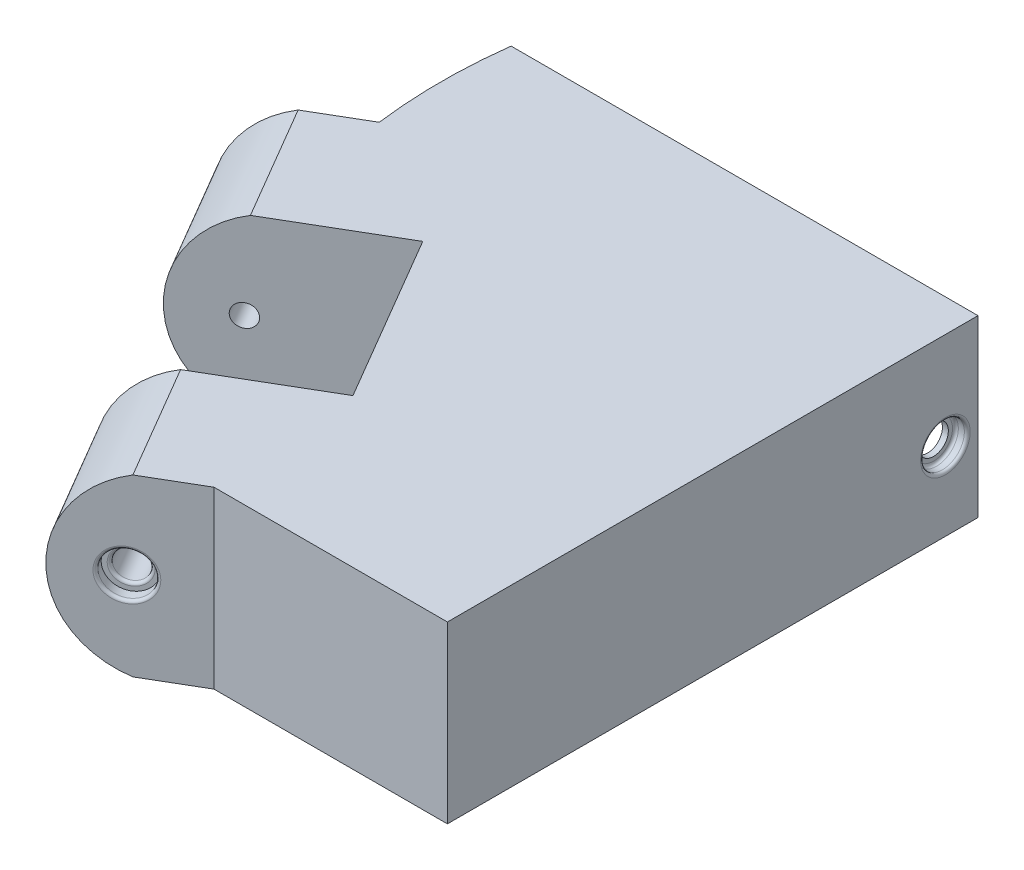
ISO-10303-21;
HEADER;
FILE_DESCRIPTION(('STEP AP214'),'2;1');
FILE_NAME('part.step','',(''),(''),'','','');
FILE_SCHEMA(('AUTOMOTIVE_DESIGN { 1 0 10303 214 1 1 1 1 }'));
ENDSEC;
DATA;
#1=APPLICATION_CONTEXT('core data for automotive mechanical design processes');
#2=APPLICATION_PROTOCOL_DEFINITION('international standard','automotive_design',2000,#1);
#3=PRODUCT_CONTEXT('',#1,'mechanical');
#4=PRODUCT('Part','Part','',(#3));
#5=PRODUCT_RELATED_PRODUCT_CATEGORY('part','',(#4));
#6=PRODUCT_DEFINITION_FORMATION('','',#4);
#7=PRODUCT_DEFINITION_CONTEXT('part definition',#1,'design');
#8=PRODUCT_DEFINITION('design','',#6,#7);
#9=PRODUCT_DEFINITION_SHAPE('','',#8);
#10=(LENGTH_UNIT() NAMED_UNIT(*) SI_UNIT(.MILLI.,.METRE.));
#11=(NAMED_UNIT(*) PLANE_ANGLE_UNIT() SI_UNIT($,.RADIAN.));
#12=(NAMED_UNIT(*) SI_UNIT($,.STERADIAN.) SOLID_ANGLE_UNIT());
#13=UNCERTAINTY_MEASURE_WITH_UNIT(LENGTH_MEASURE(1.E-05),#10,'distance_accuracy_value','');
#14=(GEOMETRIC_REPRESENTATION_CONTEXT(3) GLOBAL_UNCERTAINTY_ASSIGNED_CONTEXT((#13)) GLOBAL_UNIT_ASSIGNED_CONTEXT((#10,
#11,#12)) REPRESENTATION_CONTEXT('',''));
#15=CARTESIAN_POINT('',(0.,0.,0.));
#16=DIRECTION('',(0.,0.,1.));
#17=DIRECTION('',(1.,0.,0.));
#18=AXIS2_PLACEMENT_3D('',#15,#16,#17);
#19=CARTESIAN_POINT('',(0.,29.972,-45.466));
#20=DIRECTION('',(0.,0.,-1.));
#21=DIRECTION('',(-1.,0.,0.));
#22=AXIS2_PLACEMENT_3D('',#19,#20,#21);
#23=PLANE('',#22);
#24=DIRECTION('',(1.,0.,0.));
#25=VECTOR('',#24,1.);
#26=CARTESIAN_POINT('',(0.,0.,-45.466));
#27=LINE('',#26,#25);
#28=CARTESIAN_POINT('',(36.957,0.,-45.466));
#29=VERTEX_POINT('',#28);
#30=CARTESIAN_POINT('',(40.005,0.,-45.466));
#31=VERTEX_POINT('',#30);
#32=EDGE_CURVE('E80',#29,#31,#27,.T.);
#33=ORIENTED_EDGE('',*,*,#32,.F.);
#34=DIRECTION('',(0.,1.,0.));
#35=VECTOR('',#34,1.);
#36=CARTESIAN_POINT('',(36.957,0.,-45.466));
#37=LINE('',#36,#35);
#38=CARTESIAN_POINT('',(36.957,25.4,-45.466));
#39=VERTEX_POINT('',#38);
#40=EDGE_CURVE('E317',#29,#39,#37,.T.);
#41=ORIENTED_EDGE('',*,*,#40,.T.);
#42=DIRECTION('',(-1.,0.,0.));
#43=VECTOR('',#42,1.);
#44=CARTESIAN_POINT('',(36.957,25.4,-45.466));
#45=LINE('',#44,#43);
#46=CARTESIAN_POINT('',(-37.0121268521548,25.4,-45.466));
#47=VERTEX_POINT('',#46);
#48=EDGE_CURVE('E422',#39,#47,#45,.T.);
#49=ORIENTED_EDGE('',*,*,#48,.T.);
#50=DIRECTION('',(0.,1.,0.));
#51=VECTOR('',#50,1.);
#52=CARTESIAN_POINT('',(-37.0121268521548,0.,-45.466));
#53=LINE('',#52,#51);
#54=CARTESIAN_POINT('',(-37.0121268521548,0.,-45.466));
#55=VERTEX_POINT('',#54);
#56=EDGE_CURVE('E419',#55,#47,#53,.T.);
#57=ORIENTED_EDGE('',*,*,#56,.F.);
#58=CARTESIAN_POINT('',(-40.005,0.,-45.466));
#59=VERTEX_POINT('',#58);
#60=EDGE_CURVE('E351',#59,#55,#27,.T.);
#61=ORIENTED_EDGE('',*,*,#60,.F.);
#62=DIRECTION('',(0.,-1.,0.));
#63=VECTOR('',#62,1.);
#64=CARTESIAN_POINT('',(-40.005,29.972,-45.466));
#65=LINE('',#64,#63);
#66=CARTESIAN_POINT('',(-40.005,29.972,-45.466));
#67=VERTEX_POINT('',#66);
#68=EDGE_CURVE('E343',#67,#59,#65,.T.);
#69=ORIENTED_EDGE('',*,*,#68,.F.);
#70=DIRECTION('',(1.,0.,0.));
#71=VECTOR('',#70,1.);
#72=CARTESIAN_POINT('',(0.,29.972,-45.466));
#73=LINE('',#72,#71);
#74=CARTESIAN_POINT('',(40.005,29.972,-45.466));
#75=VERTEX_POINT('',#74);
#76=EDGE_CURVE('E350',#67,#75,#73,.T.);
#77=ORIENTED_EDGE('',*,*,#76,.T.);
#78=DIRECTION('',(0.,-1.,0.));
#79=VECTOR('',#78,1.);
#80=CARTESIAN_POINT('',(40.005,29.972,-45.466));
#81=LINE('',#80,#79);
#82=EDGE_CURVE('E341',#75,#31,#81,.T.);
#83=ORIENTED_EDGE('',*,*,#82,.T.);
#84=EDGE_LOOP('',(#33,#41,#49,#57,#61,#69,#77,#83));
#85=FACE_BOUND('',#84,.T.);
#86=ADVANCED_FACE('F41',(#85),#23,.T.);
#87=CARTESIAN_POINT('',(0.,0.,0.));
#88=DIRECTION('',(0.,1.,0.));
#89=DIRECTION('',(0.,0.,1.));
#90=AXIS2_PLACEMENT_3D('',#87,#88,#89);
#91=PLANE('',#90);
#92=DIRECTION('',(0.505266613502239,0.,0.86296329544192));
#93=VECTOR('',#92,1.);
#94=CARTESIAN_POINT('',(-1.68672431776005,0.,19.9634616738671));
#95=LINE('',#94,#93);
#96=CARTESIAN_POINT('',(-18.5909347484377,0.,-8.90785645852832));
#97=VERTEX_POINT('',#96);
#98=CARTESIAN_POINT('',(-1.68672431776005,0.,19.9634616738671));
#99=VERTEX_POINT('',#98);
#100=EDGE_CURVE('E179',#97,#99,#95,.T.);
#101=ORIENTED_EDGE('',*,*,#100,.F.);
#102=DIRECTION('',(-0.86296329544192,0.,0.505266613502239));
#103=VECTOR('',#102,1.);
#104=CARTESIAN_POINT('',(-28.4546052153388,0.,-3.13265906619772));
#105=LINE('',#104,#103);
#106=CARTESIAN_POINT('',(-37.2223122970287,0.,2.00084972698503));
#107=VERTEX_POINT('',#106);
#108=EDGE_CURVE('E337',#97,#107,#105,.T.);
#109=ORIENTED_EDGE('',*,*,#108,.T.);
#110=DIRECTION('',(0.50526661350224,0.,0.86296329544192));
#111=VECTOR('',#110,1.);
#112=CARTESIAN_POINT('',(-48.7727070816899,0.,-17.7264912068173));
#113=LINE('',#112,#111);
#114=CARTESIAN_POINT('',(-48.7727070816899,0.,-17.7264912068173));
#115=VERTEX_POINT('',#114);
#116=EDGE_CURVE('E169',#115,#107,#113,.T.);
#117=ORIENTED_EDGE('',*,*,#116,.F.);
#118=DIRECTION('',(0.86296329544192,0.,-0.505266613502239));
#119=VECTOR('',#118,1.);
#120=CARTESIAN_POINT('',(-48.7727070816899,0.,-17.7264912068173));
#121=LINE('',#120,#119);
#122=CARTESIAN_POINT('',(-40.005,0.,-22.86));
#123=VERTEX_POINT('',#122);
#124=EDGE_CURVE('E339',#115,#123,#121,.T.);
#125=ORIENTED_EDGE('',*,*,#124,.T.);
#126=CARTESIAN_POINT('',(48.215769571967,0.,-34.163));
#127=DIRECTION('',(0.,1.,0.));
#128=DIRECTION('',(0.,0.,-1.));
#129=AXIS2_PLACEMENT_3D('',#126,#127,#128);
#130=CIRCLE('',#129,88.9419023456891);
#131=EDGE_CURVE('E398',#59,#123,#130,.T.);
#132=ORIENTED_EDGE('',*,*,#131,.F.);
#133=ORIENTED_EDGE('',*,*,#60,.T.);
#134=DIRECTION('',(0.,0.,-1.));
#135=VECTOR('',#134,1.);
#136=CARTESIAN_POINT('',(-37.0121268521548,0.,-22.606));
#137=LINE('',#136,#135);
#138=CARTESIAN_POINT('',(-37.0121268521548,0.,-22.606));
#139=VERTEX_POINT('',#138);
#140=EDGE_CURVE('E414',#139,#55,#137,.T.);
#141=ORIENTED_EDGE('',*,*,#140,.F.);
#142=DIRECTION('',(-1.,0.,0.));
#143=VECTOR('',#142,1.);
#144=CARTESIAN_POINT('',(36.957,0.,-22.606));
#145=LINE('',#144,#143);
#146=CARTESIAN_POINT('',(36.957,0.,-22.606));
#147=VERTEX_POINT('',#146);
#148=EDGE_CURVE('E418',#147,#139,#145,.T.);
#149=ORIENTED_EDGE('',*,*,#148,.F.);
#150=DIRECTION('',(0.,0.,-1.));
#151=VECTOR('',#150,1.);
#152=CARTESIAN_POINT('',(36.957,0.,-22.606));
#153=LINE('',#152,#151);
#154=EDGE_CURVE('E416',#147,#29,#153,.T.);
#155=ORIENTED_EDGE('',*,*,#154,.T.);
#156=ORIENTED_EDGE('',*,*,#32,.T.);
#157=DIRECTION('',(0.,0.,-1.));
#158=VECTOR('',#157,1.);
#159=CARTESIAN_POINT('',(40.005,0.,0.));
#160=LINE('',#159,#158);
#161=CARTESIAN_POINT('',(40.005,0.,45.466));
#162=VERTEX_POINT('',#161);
#163=EDGE_CURVE('E354',#162,#31,#160,.T.);
#164=ORIENTED_EDGE('',*,*,#163,.F.);
#165=DIRECTION('',(1.,0.,0.));
#166=VECTOR('',#165,1.);
#167=CARTESIAN_POINT('',(0.,0.,45.466));
#168=LINE('',#167,#166);
#169=CARTESIAN_POINT('',(0.,0.,45.466));
#170=VERTEX_POINT('',#169);
#171=EDGE_CURVE('E357',#170,#162,#168,.T.);
#172=ORIENTED_EDGE('',*,*,#171,.F.);
#173=DIRECTION('',(-0.86296329544192,0.,0.505266613502239));
#174=VECTOR('',#173,1.);
#175=CARTESIAN_POINT('',(0.,0.,45.466));
#176=LINE('',#175,#174);
#177=CARTESIAN_POINT('',(-8.76770708168991,0.,50.5995087931827));
#178=VERTEX_POINT('',#177);
#179=EDGE_CURVE('E374',#170,#178,#176,.T.);
#180=ORIENTED_EDGE('',*,*,#179,.T.);
#181=DIRECTION('',(0.505266613502239,0.,0.86296329544192));
#182=VECTOR('',#181,1.);
#183=CARTESIAN_POINT('',(-20.3181018663511,0.,30.8721678593804));
#184=LINE('',#183,#182);
#185=CARTESIAN_POINT('',(-20.3181018663511,0.,30.8721678593805));
#186=VERTEX_POINT('',#185);
#187=EDGE_CURVE('E376',#186,#178,#184,.T.);
#188=ORIENTED_EDGE('',*,*,#187,.F.);
#189=DIRECTION('',(0.86296329544192,0.,-0.505266613502239));
#190=VECTOR('',#189,1.);
#191=CARTESIAN_POINT('',(-20.3181018663511,0.,30.8721678593804));
#192=LINE('',#191,#190);
#193=EDGE_CURVE('E371',#186,#99,#192,.T.);
#194=ORIENTED_EDGE('',*,*,#193,.T.);
#195=EDGE_LOOP('',(#101,#109,#117,#125,#132,#133,#141,#149,#155,#156,#164,#172,#180,#188,#194));
#196=FACE_BOUND('',#195,.T.);
#197=ADVANCED_FACE('F271',(#196),#91,.F.);
#198=CARTESIAN_POINT('',(0.,29.972,45.466));
#199=DIRECTION('',(0.,0.,-1.));
#200=DIRECTION('',(-1.,0.,0.));
#201=AXIS2_PLACEMENT_3D('',#198,#199,#200);
#202=PLANE('',#201);
#203=ORIENTED_EDGE('',*,*,#171,.T.);
#204=DIRECTION('',(0.,-1.,0.));
#205=VECTOR('',#204,1.);
#206=CARTESIAN_POINT('',(40.005,29.972,45.466));
#207=LINE('',#206,#205);
#208=CARTESIAN_POINT('',(40.005,29.972,45.466));
#209=VERTEX_POINT('',#208);
#210=EDGE_CURVE('E329',#209,#162,#207,.T.);
#211=ORIENTED_EDGE('',*,*,#210,.F.);
#212=DIRECTION('',(1.,0.,0.));
#213=VECTOR('',#212,1.);
#214=CARTESIAN_POINT('',(0.,29.972,45.466));
#215=LINE('',#214,#213);
#216=CARTESIAN_POINT('',(0.,29.972,45.466));
#217=VERTEX_POINT('',#216);
#218=EDGE_CURVE('E65',#217,#209,#215,.T.);
#219=ORIENTED_EDGE('',*,*,#218,.F.);
#220=DIRECTION('',(0.,-1.,0.));
#221=VECTOR('',#220,1.);
#222=CARTESIAN_POINT('',(0.,29.972,45.466));
#223=LINE('',#222,#221);
#224=EDGE_CURVE('E348',#217,#170,#223,.T.);
#225=ORIENTED_EDGE('',*,*,#224,.T.);
#226=EDGE_LOOP('',(#203,#211,#219,#225));
#227=FACE_BOUND('',#226,.T.);
#228=ADVANCED_FACE('F274',(#227),#202,.F.);
#229=CARTESIAN_POINT('',(40.005,29.972,0.));
#230=DIRECTION('',(-1.,0.,0.));
#231=DIRECTION('',(0.,0.,1.));
#232=AXIS2_PLACEMENT_3D('',#229,#230,#231);
#233=PLANE('',#232);
#234=CARTESIAN_POINT('',(40.005,13.3918373791494,-39.878));
#235=DIRECTION('',(-1.,0.,0.));
#236=DIRECTION('',(0.,0.,1.));
#237=AXIS2_PLACEMENT_3D('',#234,#235,#236);
#238=CIRCLE('',#237,4.2500052);
#239=CARTESIAN_POINT('',(40.005,13.3918373791494,-35.6279948));
#240=VERTEX_POINT('',#239);
#241=EDGE_CURVE('E49',#240,#240,#238,.T.);
#242=ORIENTED_EDGE('',*,*,#241,.T.);
#243=EDGE_LOOP('',(#242));
#244=FACE_BOUND('',#243,.T.);
#245=ORIENTED_EDGE('',*,*,#163,.T.);
#246=ORIENTED_EDGE('',*,*,#82,.F.);
#247=DIRECTION('',(0.,0.,-1.));
#248=VECTOR('',#247,1.);
#249=CARTESIAN_POINT('',(40.005,29.972,0.));
#250=LINE('',#249,#248);
#251=EDGE_CURVE('E86',#209,#75,#250,.T.);
#252=ORIENTED_EDGE('',*,*,#251,.F.);
#253=ORIENTED_EDGE('',*,*,#210,.T.);
#254=EDGE_LOOP('',(#245,#246,#252,#253));
#255=FACE_BOUND('',#254,.T.);
#256=ADVANCED_FACE('F270',(#244,#255),#233,.F.);
#257=CARTESIAN_POINT('',(0.,29.972,0.));
#258=DIRECTION('',(0.,1.,0.));
#259=DIRECTION('',(0.,0.,1.));
#260=AXIS2_PLACEMENT_3D('',#257,#258,#259);
#261=PLANE('',#260);
#262=DIRECTION('',(-0.86296329544192,0.,0.505266613502239));
#263=VECTOR('',#262,1.);
#264=CARTESIAN_POINT('',(-28.4546052153388,29.9719999999999,-3.13265906619772));
#265=LINE('',#264,#263);
#266=CARTESIAN_POINT('',(-18.5909347484377,29.972,-8.90785645852832));
#267=VERTEX_POINT('',#266);
#268=CARTESIAN_POINT('',(-37.2223122970287,29.9719999999999,2.00084972698503));
#269=VERTEX_POINT('',#268);
#270=EDGE_CURVE('E184',#267,#269,#265,.T.);
#271=ORIENTED_EDGE('',*,*,#270,.F.);
#272=DIRECTION('',(-0.505266613502239,0.,-0.86296329544192));
#273=VECTOR('',#272,1.);
#274=CARTESIAN_POINT('',(-1.68672431776005,29.972,19.9634616738671));
#275=LINE('',#274,#273);
#276=CARTESIAN_POINT('',(-1.68672431776005,29.972,19.9634616738671));
#277=VERTEX_POINT('',#276);
#278=EDGE_CURVE('E177',#277,#267,#275,.T.);
#279=ORIENTED_EDGE('',*,*,#278,.F.);
#280=DIRECTION('',(0.86296329544192,0.,-0.505266613502239));
#281=VECTOR('',#280,1.);
#282=CARTESIAN_POINT('',(-20.3181018663511,29.9719999999999,30.8721678593804));
#283=LINE('',#282,#281);
#284=CARTESIAN_POINT('',(-20.3181018663511,29.9719999999999,30.8721678593804));
#285=VERTEX_POINT('',#284);
#286=EDGE_CURVE('E160',#285,#277,#283,.T.);
#287=ORIENTED_EDGE('',*,*,#286,.F.);
#288=DIRECTION('',(0.505266613502239,0.,0.86296329544192));
#289=VECTOR('',#288,1.);
#290=CARTESIAN_POINT('',(-20.3181018663511,29.9719999999999,30.8721678593804));
#291=LINE('',#290,#289);
#292=CARTESIAN_POINT('',(-8.76770708168991,29.9719999999999,50.5995087931827));
#293=VERTEX_POINT('',#292);
#294=EDGE_CURVE('E373',#285,#293,#291,.T.);
#295=ORIENTED_EDGE('',*,*,#294,.T.);
#296=DIRECTION('',(-0.86296329544192,0.,0.505266613502239));
#297=VECTOR('',#296,1.);
#298=CARTESIAN_POINT('',(0.,29.9719999999999,45.466));
#299=LINE('',#298,#297);
#300=EDGE_CURVE('E170',#217,#293,#299,.T.);
#301=ORIENTED_EDGE('',*,*,#300,.F.);
#302=ORIENTED_EDGE('',*,*,#218,.T.);
#303=ORIENTED_EDGE('',*,*,#251,.T.);
#304=ORIENTED_EDGE('',*,*,#76,.F.);
#305=CARTESIAN_POINT('',(48.215769571967,29.972,-34.163));
#306=DIRECTION('',(0.,1.,0.));
#307=DIRECTION('',(0.,0.,-1.));
#308=AXIS2_PLACEMENT_3D('',#305,#306,#307);
#309=CIRCLE('',#308,88.9419023456891);
#310=CARTESIAN_POINT('',(-40.005,29.972,-22.86));
#311=VERTEX_POINT('',#310);
#312=EDGE_CURVE('E399',#67,#311,#309,.T.);
#313=ORIENTED_EDGE('',*,*,#312,.T.);
#314=DIRECTION('',(0.86296329544192,0.,-0.505266613502239));
#315=VECTOR('',#314,1.);
#316=CARTESIAN_POINT('',(-48.7727070816899,29.9719999999999,-17.7264912068173));
#317=LINE('',#316,#315);
#318=CARTESIAN_POINT('',(-48.7727070816899,29.9719999999999,-17.7264912068173));
#319=VERTEX_POINT('',#318);
#320=EDGE_CURVE('E333',#319,#311,#317,.T.);
#321=ORIENTED_EDGE('',*,*,#320,.F.);
#322=DIRECTION('',(0.50526661350224,0.,0.86296329544192));
#323=VECTOR('',#322,1.);
#324=CARTESIAN_POINT('',(-48.7727070816899,29.9719999999999,-17.7264912068173));
#325=LINE('',#324,#323);
#326=EDGE_CURVE('E334',#319,#269,#325,.T.);
#327=ORIENTED_EDGE('',*,*,#326,.T.);
#328=EDGE_LOOP('',(#271,#279,#287,#295,#301,#302,#303,#304,#313,#321,#327));
#329=FACE_BOUND('',#328,.T.);
#330=ADVANCED_FACE('F182',(#329),#261,.T.);
#331=CARTESIAN_POINT('',(-28.4546052153388,29.9719999999999,-3.13265906619772));
#332=DIRECTION('',(0.505266613502239,0.,0.86296329544192));
#333=DIRECTION('',(0.86296329544192,0.,-0.505266613502239));
#334=AXIS2_PLACEMENT_3D('',#331,#332,#333);
#335=PLANE('',#334);
#336=CARTESIAN_POINT('',(-37.8683698058319,14.9859999999999,2.37911759923966));
#337=DIRECTION('',(0.505266613502239,0.,0.86296329544192));
#338=DIRECTION('',(0.86296329544192,0.,-0.505266613502239));
#339=AXIS2_PLACEMENT_3D('',#336,#337,#338);
#340=CIRCLE('',#339,1.905);
#341=CARTESIAN_POINT('',(-36.224424728015,14.9859999999999,1.4165847005179));
#342=VERTEX_POINT('',#341);
#343=EDGE_CURVE('E390',#342,#342,#340,.T.);
#344=ORIENTED_EDGE('',*,*,#343,.F.);
#345=EDGE_LOOP('',(#344));
#346=FACE_BOUND('',#345,.T.);
#347=ORIENTED_EDGE('',*,*,#108,.F.);
#348=DIRECTION('',(0.,1.,0.));
#349=VECTOR('',#348,1.);
#350=CARTESIAN_POINT('',(-18.5909347484377,-43.7824221092443,-8.90785645852832));
#351=LINE('',#350,#349);
#352=EDGE_CURVE('E180',#97,#267,#351,.T.);
#353=ORIENTED_EDGE('',*,*,#352,.T.);
#354=ORIENTED_EDGE('',*,*,#270,.T.);
#355=CARTESIAN_POINT('',(-33.0461309109023,14.986,-0.444312237010894));
#356=DIRECTION('',(0.505266613502239,0.,0.86296329544192));
#357=DIRECTION('',(0.86296329544192,0.,-0.505266613502239));
#358=AXIS2_PLACEMENT_3D('',#355,#356,#357);
#359=CIRCLE('',#358,15.748);
#360=EDGE_CURVE('E387',#269,#107,#359,.T.);
#361=ORIENTED_EDGE('',*,*,#360,.T.);
#362=EDGE_LOOP('',(#347,#353,#354,#361));
#363=FACE_BOUND('',#362,.T.);
#364=ADVANCED_FACE('F263',(#346,#363),#335,.T.);
#365=CARTESIAN_POINT('',(-48.7727070816899,29.9719999999999,-17.7264912068173));
#366=DIRECTION('',(-0.505266613502239,0.,-0.86296329544192));
#367=DIRECTION('',(-0.86296329544192,0.,0.505266613502239));
#368=AXIS2_PLACEMENT_3D('',#365,#366,#367);
#369=PLANE('',#368);
#370=CARTESIAN_POINT('',(-49.4187645904931,14.9859999999999,-17.3482233345626));
#371=DIRECTION('',(-0.505266613502239,0.,-0.86296329544192));
#372=DIRECTION('',(-0.86296329544192,0.,0.505266613502239));
#373=AXIS2_PLACEMENT_3D('',#370,#371,#372);
#374=CIRCLE('',#373,1.905);
#375=CARTESIAN_POINT('',(-51.06270966831,14.9859999999999,-16.3856904358408));
#376=VERTEX_POINT('',#375);
#377=EDGE_CURVE('E395',#376,#376,#374,.T.);
#378=ORIENTED_EDGE('',*,*,#377,.F.);
#379=EDGE_LOOP('',(#378));
#380=FACE_BOUND('',#379,.T.);
#381=ORIENTED_EDGE('',*,*,#124,.F.);
#382=CARTESIAN_POINT('',(-44.5965256955635,14.986,-20.1716531708132));
#383=DIRECTION('',(0.505266613502239,0.,0.86296329544192));
#384=DIRECTION('',(0.86296329544192,0.,-0.505266613502239));
#385=AXIS2_PLACEMENT_3D('',#382,#383,#384);
#386=CIRCLE('',#385,15.748);
#387=EDGE_CURVE('E385',#319,#115,#386,.T.);
#388=ORIENTED_EDGE('',*,*,#387,.F.);
#389=ORIENTED_EDGE('',*,*,#320,.T.);
#390=DIRECTION('',(0.,-1.,0.));
#391=VECTOR('',#390,1.);
#392=CARTESIAN_POINT('',(-40.005,29.972,-22.86));
#393=LINE('',#392,#391);
#394=EDGE_CURVE('E345',#311,#123,#393,.T.);
#395=ORIENTED_EDGE('',*,*,#394,.T.);
#396=EDGE_LOOP('',(#381,#388,#389,#395));
#397=FACE_BOUND('',#396,.T.);
#398=ADVANCED_FACE('F259',(#380,#397),#369,.T.);
#399=CARTESIAN_POINT('',(0.,29.9719999999999,45.466));
#400=DIRECTION('',(0.505266613502239,0.,0.86296329544192));
#401=DIRECTION('',(0.86296329544192,0.,-0.505266613502239));
#402=AXIS2_PLACEMENT_3D('',#399,#400,#401);
#403=PLANE('',#402);
#404=CARTESIAN_POINT('',(-9.41376459049303,14.9859999999999,50.9777766654374));
#405=DIRECTION('',(0.505266613502239,0.,0.86296329544192));
#406=DIRECTION('',(0.86296329544192,0.,-0.505266613502239));
#407=AXIS2_PLACEMENT_3D('',#404,#405,#406);
#408=CIRCLE('',#407,4.2500052);
#409=CARTESIAN_POINT('',(-5.74616609745573,14.9859999999999,48.8303909306664));
#410=VERTEX_POINT('',#409);
#411=EDGE_CURVE('E323',#410,#410,#408,.F.);
#412=ORIENTED_EDGE('',*,*,#411,.T.);
#413=EDGE_LOOP('',(#412));
#414=FACE_BOUND('',#413,.T.);
#415=ORIENTED_EDGE('',*,*,#179,.F.);
#416=ORIENTED_EDGE('',*,*,#224,.F.);
#417=ORIENTED_EDGE('',*,*,#300,.T.);
#418=CARTESIAN_POINT('',(-4.59152569556352,14.986,48.1543468291868));
#419=DIRECTION('',(0.50526661350224,0.,0.86296329544192));
#420=DIRECTION('',(0.86296329544192,0.,-0.50526661350224));
#421=AXIS2_PLACEMENT_3D('',#418,#419,#420);
#422=CIRCLE('',#421,15.748);
#423=EDGE_CURVE('E382',#293,#178,#422,.T.);
#424=ORIENTED_EDGE('',*,*,#423,.T.);
#425=EDGE_LOOP('',(#415,#416,#417,#424));
#426=FACE_BOUND('',#425,.T.);
#427=ADVANCED_FACE('F255',(#414,#426),#403,.T.);
#428=CARTESIAN_POINT('',(-20.3181018663511,29.9719999999999,30.8721678593804));
#429=DIRECTION('',(-0.505266613502239,0.,-0.86296329544192));
#430=DIRECTION('',(-0.86296329544192,0.,0.505266613502239));
#431=AXIS2_PLACEMENT_3D('',#428,#429,#430);
#432=PLANE('',#431);
#433=CARTESIAN_POINT('',(-20.9641593751542,14.9859999999999,31.250435731635));
#434=DIRECTION('',(-0.505266613502239,0.,-0.86296329544192));
#435=DIRECTION('',(-0.86296329544192,0.,0.505266613502239));
#436=AXIS2_PLACEMENT_3D('',#433,#434,#435);
#437=CIRCLE('',#436,2.5);
#438=CARTESIAN_POINT('',(-23.121567613759,14.9859999999999,32.5136022653906));
#439=VERTEX_POINT('',#438);
#440=EDGE_CURVE('E406',#439,#439,#437,.F.);
#441=ORIENTED_EDGE('',*,*,#440,.T.);
#442=EDGE_LOOP('',(#441));
#443=FACE_BOUND('',#442,.T.);
#444=ORIENTED_EDGE('',*,*,#193,.F.);
#445=CARTESIAN_POINT('',(-16.1419204802247,14.986,28.4270058953846));
#446=DIRECTION('',(0.50526661350224,0.,0.86296329544192));
#447=DIRECTION('',(0.86296329544192,0.,-0.50526661350224));
#448=AXIS2_PLACEMENT_3D('',#445,#446,#447);
#449=CIRCLE('',#448,15.748);
#450=EDGE_CURVE('E165',#285,#186,#449,.T.);
#451=ORIENTED_EDGE('',*,*,#450,.F.);
#452=ORIENTED_EDGE('',*,*,#286,.T.);
#453=DIRECTION('',(0.,1.,0.));
#454=VECTOR('',#453,1.);
#455=CARTESIAN_POINT('',(-1.68672431776005,-43.7824221092443,19.9634616738671));
#456=LINE('',#455,#454);
#457=EDGE_CURVE('E163',#99,#277,#456,.T.);
#458=ORIENTED_EDGE('',*,*,#457,.F.);
#459=EDGE_LOOP('',(#444,#451,#452,#458));
#460=FACE_BOUND('',#459,.T.);
#461=ADVANCED_FACE('F162',(#443,#460),#432,.T.);
#462=CARTESIAN_POINT('',(-16.1419204802247,14.986,28.4270058953846));
#463=DIRECTION('',(0.50526661350224,0.,0.86296329544192));
#464=DIRECTION('',(0.86296329544192,0.,-0.50526661350224));
#465=AXIS2_PLACEMENT_3D('',#462,#463,#464);
#466=CYLINDRICAL_SURFACE('',#465,15.748);
#467=ORIENTED_EDGE('',*,*,#423,.F.);
#468=ORIENTED_EDGE('',*,*,#294,.F.);
#469=ORIENTED_EDGE('',*,*,#450,.T.);
#470=ORIENTED_EDGE('',*,*,#187,.T.);
#471=EDGE_LOOP('',(#467,#468,#469,#470));
#472=FACE_BOUND('',#471,.T.);
#473=ADVANCED_FACE('F248',(#472),#466,.T.);
#474=CARTESIAN_POINT('',(-44.5965256955635,14.986,-20.1716531708132));
#475=DIRECTION('',(0.505266613502239,0.,0.86296329544192));
#476=DIRECTION('',(0.86296329544192,0.,-0.505266613502239));
#477=AXIS2_PLACEMENT_3D('',#474,#475,#476);
#478=CYLINDRICAL_SURFACE('',#477,15.748);
#479=ORIENTED_EDGE('',*,*,#360,.F.);
#480=ORIENTED_EDGE('',*,*,#326,.F.);
#481=ORIENTED_EDGE('',*,*,#387,.T.);
#482=ORIENTED_EDGE('',*,*,#116,.T.);
#483=EDGE_LOOP('',(#479,#480,#481,#482));
#484=FACE_BOUND('',#483,.T.);
#485=ADVANCED_FACE('F244',(#484),#478,.T.);
#486=CARTESIAN_POINT('',(-63.9172076015703,14.9859999999999,-42.1106434614182));
#487=DIRECTION('',(0.505266613502241,0.,0.862963295441919));
#488=DIRECTION('',(0.862963295441919,0.,-0.505266613502241));
#489=AXIS2_PLACEMENT_3D('',#486,#487,#488);
#490=CYLINDRICAL_SURFACE('',#489,1.905);
#491=ORIENTED_EDGE('',*,*,#343,.T.);
#492=EDGE_LOOP('',(#491));
#493=FACE_BOUND('',#492,.T.);
#494=ORIENTED_EDGE('',*,*,#377,.T.);
#495=EDGE_LOOP('',(#494));
#496=FACE_BOUND('',#495,.T.);
#497=ADVANCED_FACE('F240',(#493,#496),#490,.F.);
#498=CARTESIAN_POINT('',(48.215769571967,0.,-34.163));
#499=DIRECTION('',(0.,1.,0.));
#500=DIRECTION('',(0.,0.,1.));
#501=AXIS2_PLACEMENT_3D('',#498,#499,#500);
#502=CYLINDRICAL_SURFACE('',#501,88.9419023456891);
#503=CARTESIAN_POINT('',(-40.3991140135239,13.3918373791494,-41.783));
#504=CARTESIAN_POINT('',(-40.3991145984771,13.4985702288386,-41.7829952226778));
#505=CARTESIAN_POINT('',(-40.3998894065204,13.6053803244148,-41.7739993557784));
#506=CARTESIAN_POINT('',(-40.4029529368075,13.8160523223333,-41.7382441030562));
#507=CARTESIAN_POINT('',(-40.4052434758309,13.9199105304975,-41.7114633999044));
#508=CARTESIAN_POINT('',(-40.4112237846502,14.1215903975684,-41.6409199689853));
#509=CARTESIAN_POINT('',(-40.4149127604157,14.2194154455147,-41.5971668777896));
#510=CARTESIAN_POINT('',(-40.4235098291932,14.4062973092857,-41.493948715266));
#511=CARTESIAN_POINT('',(-40.4284176328798,14.4953561990252,-41.4344873725498));
#512=CARTESIAN_POINT('',(-40.4392330289214,14.6624049465795,-41.3014142813525));
#513=CARTESIAN_POINT('',(-40.4451425643753,14.7403727394001,-41.2277749929079));
#514=CARTESIAN_POINT('',(-40.4576891354417,14.8828525816686,-41.0685109361905));
#515=CARTESIAN_POINT('',(-40.4643262115279,14.9473638819398,-40.982885501044));
#516=CARTESIAN_POINT('',(-40.4780684132198,15.0613115567474,-40.8017767990109));
#517=CARTESIAN_POINT('',(-40.4851749770254,15.1106987249213,-40.7062626799741));
#518=CARTESIAN_POINT('',(-40.4995554531986,15.1927303856319,-40.5083082986872));
#519=CARTESIAN_POINT('',(-40.5068293673162,15.2253747029951,-40.4058679639836));
#520=CARTESIAN_POINT('',(-40.5212957579741,15.2730444108805,-40.1967573438411));
#521=CARTESIAN_POINT('',(-40.5284880565254,15.2880366966598,-40.0900794972522));
#522=CARTESIAN_POINT('',(-40.5425459983963,15.2998583939643,-39.8757005378395));
#523=CARTESIAN_POINT('',(-40.5494116422126,15.2966878331052,-39.7679994265717));
#524=CARTESIAN_POINT('',(-40.5626254124623,15.2722631486392,-39.5546601611552));
#525=CARTESIAN_POINT('',(-40.5689736600131,15.2510132706264,-39.4490215286287));
#526=CARTESIAN_POINT('',(-40.5810117335341,15.1910230950643,-39.2427931728613));
#527=CARTESIAN_POINT('',(-40.5867015638053,15.1522829117789,-39.1422034166409));
#528=CARTESIAN_POINT('',(-40.5973182871733,15.0584735980714,-38.9491012070098));
#529=CARTESIAN_POINT('',(-40.602246356745,15.0034300381708,-38.8565763963455));
#530=CARTESIAN_POINT('',(-40.6112961205733,14.8785451468689,-38.6820750821851));
#531=CARTESIAN_POINT('',(-40.615417822288,14.8087039523429,-38.6000984811313));
#532=CARTESIAN_POINT('',(-40.6228281974552,14.6563331469676,-38.449169905296));
#533=CARTESIAN_POINT('',(-40.6261182533245,14.5738249640022,-38.3801963651408));
#534=CARTESIAN_POINT('',(-40.6318771802747,14.398376065476,-38.2570774910049));
#535=CARTESIAN_POINT('',(-40.6343460563606,14.3054354135048,-38.2029320666485));
#536=CARTESIAN_POINT('',(-40.6384754007026,14.1118726956238,-38.111071116223));
#537=CARTESIAN_POINT('',(-40.6401367702986,14.011259339854,-38.0733372764909));
#538=CARTESIAN_POINT('',(-40.6426723991091,13.8051176592505,-38.015289537994));
#539=CARTESIAN_POINT('',(-40.6435466609455,13.6995893507898,-37.9949755812032));
#540=CARTESIAN_POINT('',(-40.644519339621,13.4866732271688,-37.9723540648882));
#541=CARTESIAN_POINT('',(-40.6446181663334,13.3792864244453,-37.9700369927213));
#542=CARTESIAN_POINT('',(-40.6440424688497,13.1656481076597,-37.9834502716791));
#543=CARTESIAN_POINT('',(-40.6433679457169,13.0593965920368,-37.9991805979898));
#544=CARTESIAN_POINT('',(-40.6412364862959,12.8510578004354,-38.0482366278414));
#545=CARTESIAN_POINT('',(-40.639779642501,12.7489700337146,-38.0815602513307));
#546=CARTESIAN_POINT('',(-40.636067291269,12.5518417433198,-38.1648504024927));
#547=CARTESIAN_POINT('',(-40.6338117840558,12.4568012176711,-38.2148169255018));
#548=CARTESIAN_POINT('',(-40.6284850632139,12.2764407710029,-38.3299799576255));
#549=CARTESIAN_POINT('',(-40.6254136675823,12.1911230249507,-38.3951798645085));
#550=CARTESIAN_POINT('',(-40.6184483746539,12.0326471923311,-38.538943323708));
#551=CARTESIAN_POINT('',(-40.614554475406,11.959489134609,-38.6175069077249));
#552=CARTESIAN_POINT('',(-40.6059543993626,11.8273515597673,-38.7858168292402));
#553=CARTESIAN_POINT('',(-40.6012476677329,11.7683817937208,-38.8755707935088));
#554=CARTESIAN_POINT('',(-40.5910677443601,11.6663437884908,-39.0636630090987));
#555=CARTESIAN_POINT('',(-40.5855945488481,11.6232756275044,-39.1620013026312));
#556=CARTESIAN_POINT('',(-40.5739574571973,11.5541982584434,-39.364602387104));
#557=CARTESIAN_POINT('',(-40.5677926673123,11.5282114288766,-39.4688727563087));
#558=CARTESIAN_POINT('',(-40.5549069904627,11.4941051857787,-39.6802624191582));
#559=CARTESIAN_POINT('',(-40.5481860967265,11.4859859898513,-39.7873817474834));
#560=CARTESIAN_POINT('',(-40.5343514106416,11.4878317529705,-40.001626677472));
#561=CARTESIAN_POINT('',(-40.5272369539745,11.4978282531711,-40.1087519647212));
#562=CARTESIAN_POINT('',(-40.5128454163572,11.5356749169761,-40.3197902714454));
#563=CARTESIAN_POINT('',(-40.5055683334565,11.5635252948007,-40.4237032523619));
#564=CARTESIAN_POINT('',(-40.4910969840912,11.6363398126667,-40.6255130507437));
#565=CARTESIAN_POINT('',(-40.4839028402583,11.6813266002767,-40.7234017067068));
#566=CARTESIAN_POINT('',(-40.4698868308385,11.7871415587023,-40.9102311657844));
#567=CARTESIAN_POINT('',(-40.4630649513682,11.8479691382577,-40.9991723026949));
#568=CARTESIAN_POINT('',(-40.4500829265601,11.9837223333533,-41.1655399418466));
#569=CARTESIAN_POINT('',(-40.4439224820712,12.0586415330445,-41.2429716556644));
#570=CARTESIAN_POINT('',(-40.4325341153473,12.2205067997989,-41.384168776946));
#571=CARTESIAN_POINT('',(-40.4273064137722,12.3074557041268,-41.4479309513102));
#572=CARTESIAN_POINT('',(-40.4180406088043,12.490706037423,-41.5598129014005));
#573=CARTESIAN_POINT('',(-40.414000197935,12.5869888350263,-41.6079630379121));
#574=CARTESIAN_POINT('',(-40.4072958377699,12.7862430133546,-41.6873519872008));
#575=CARTESIAN_POINT('',(-40.4046302061625,12.889206044886,-41.7186114712433));
#576=CARTESIAN_POINT('',(-40.4015225487763,13.0593356354682,-41.7549504267182));
#577=CARTESIAN_POINT('',(-40.4006211939267,13.1253841795211,-41.7654555799105));
#578=CARTESIAN_POINT('',(-40.3994167438567,13.2582241841592,-41.7794818542387));
#579=CARTESIAN_POINT('',(-40.3991136473049,13.3250156430907,-41.7830029909158));
#580=CARTESIAN_POINT('',(-40.3991140135239,13.3918373791494,-41.783));
#581=B_SPLINE_CURVE_WITH_KNOTS('',3,(#503,#504,#505,#506,#507,#508,#509,#510,#511,#512,#513,
#514,#515,#516,#517,#518,#519,#520,#521,#522,#523,#524,#525,#526,#527,#528,#529,#530,#531,#532,
#533,#534,#535,#536,#537,#538,#539,#540,#541,#542,#543,#544,#545,#546,#547,#548,#549,#550,#551,
#552,#553,#554,#555,#556,#557,#558,#559,#560,#561,#562,#563,#564,#565,#566,#567,#568,#569,#570,
#571,#572,#573,#574,#575,#576,#577,#578,#579,#580),.UNSPECIFIED.,.T.,.F.,(4,2,2,2,2,2,2,2,2,2,2,
2,2,2,2,2,2,2,2,2,2,2,2,2,2,2,2,2,2,2,2,2,2,2,2,2,2,2,4),(0.,0.319954151330356,
0.640292501202898,0.960449235164749,1.28053004283966,1.60123898154261,1.92196577063197,
2.24372522177086,2.56548803927431,2.88785333667041,3.21021814392943,3.53250727065164,
3.85479429189344,4.17657848492161,4.49835970164068,4.81960246177572,5.14084326392643,
5.4617246684169,5.78260500403948,6.10331571986875,6.42402599474064,6.74469836059928,
7.06537063660067,7.38611450615239,7.70685913656343,8.02782357690236,8.34878959558431,
8.67017528293092,8.9915648842992,9.31351459331408,9.63546816532361,9.95784871746207,
10.2802172384195,10.6024393402198,10.924737569647,11.2464052119661,11.5676782913924,
11.7679909363644,11.968303135592),.UNSPECIFIED.);
#582=CARTESIAN_POINT('',(-40.3991140135239,13.3918373791494,-41.783));
#583=VERTEX_POINT('',#582);
#584=EDGE_CURVE('E194',#583,#583,#581,.T.);
#585=ORIENTED_EDGE('',*,*,#584,.T.);
#586=EDGE_LOOP('',(#585));
#587=FACE_BOUND('',#586,.T.);
#588=ORIENTED_EDGE('',*,*,#312,.F.);
#589=ORIENTED_EDGE('',*,*,#68,.T.);
#590=ORIENTED_EDGE('',*,*,#131,.T.);
#591=ORIENTED_EDGE('',*,*,#394,.F.);
#592=EDGE_LOOP('',(#588,#589,#590,#591));
#593=FACE_BOUND('',#592,.T.);
#594=ADVANCED_FACE('F236',(#587,#593),#502,.T.);
#595=CARTESIAN_POINT('',(-10.4404663491296,16.8610026,49.2242352490994));
#596=DIRECTION('',(-0.505266613502239,0.,-0.86296329544192));
#597=DIRECTION('',(-0.86296329544192,0.,0.505266613502239));
#598=AXIS2_PLACEMENT_3D('',#595,#596,#597);
#599=PLANE('',#598);
#600=CARTESIAN_POINT('',(-10.4404663491295,14.9859999999999,49.2242352490994));
#601=DIRECTION('',(-0.505266613502239,0.,-0.86296329544192));
#602=DIRECTION('',(-0.86296329544192,0.,0.505266613502239));
#603=AXIS2_PLACEMENT_3D('',#600,#601,#602);
#604=CIRCLE('',#603,3.);
#605=CARTESIAN_POINT('',(-13.0293562354553,14.9859999999999,50.7400350896061));
#606=VERTEX_POINT('',#605);
#607=EDGE_CURVE('E310',#606,#606,#604,.T.);
#608=ORIENTED_EDGE('',*,*,#607,.T.);
#609=EDGE_LOOP('',(#608));
#610=FACE_BOUND('',#609,.T.);
#611=CARTESIAN_POINT('',(-10.4404663491296,14.9859999999999,49.2242352490994));
#612=DIRECTION('',(0.505266613502239,0.,0.86296329544192));
#613=DIRECTION('',(0.86296329544192,0.,-0.505266613502239));
#614=AXIS2_PLACEMENT_3D('',#611,#612,#613);
#615=CIRCLE('',#614,3.7500052);
#616=CARTESIAN_POINT('',(-7.20434950381323,14.9859999999999,47.3294828210796));
#617=VERTEX_POINT('',#616);
#618=EDGE_CURVE('E402',#617,#617,#615,.T.);
#619=ORIENTED_EDGE('',*,*,#618,.T.);
#620=EDGE_LOOP('',(#619));
#621=FACE_BOUND('',#620,.T.);
#622=ADVANCED_FACE('F232',(#610,#621),#599,.F.);
#623=CARTESIAN_POINT('',(-9.41376459049302,14.9859999999999,50.9777766654374));
#624=DIRECTION('',(0.505266613502239,0.,0.86296329544192));
#625=DIRECTION('',(0.86296329544192,0.,-0.505266613502239));
#626=AXIS2_PLACEMENT_3D('',#623,#624,#625);
#627=CYLINDRICAL_SURFACE('',#626,3.7500052);
#628=CARTESIAN_POINT('',(-9.66639789724415,14.9859999999999,50.5462950177164));
#629=DIRECTION('',(0.505266613502239,0.,0.86296329544192));
#630=DIRECTION('',(0.86296329544192,0.,-0.505266613502239));
#631=AXIS2_PLACEMENT_3D('',#628,#629,#630);
#632=CIRCLE('',#631,3.7500052);
#633=CARTESIAN_POINT('',(-6.43028105192781,14.9859999999999,48.6515425896966));
#634=VERTEX_POINT('',#633);
#635=EDGE_CURVE('E326',#634,#634,#632,.T.);
#636=ORIENTED_EDGE('',*,*,#635,.T.);
#637=EDGE_LOOP('',(#636));
#638=FACE_BOUND('',#637,.T.);
#639=ORIENTED_EDGE('',*,*,#618,.F.);
#640=EDGE_LOOP('',(#639));
#641=FACE_BOUND('',#640,.T.);
#642=ADVANCED_FACE('F228',(#638,#641),#627,.F.);
#643=CARTESIAN_POINT('',(-24.5369338623002,14.9859999999999,25.1483637504143));
#644=DIRECTION('',(0.505266613502239,0.,0.86296329544192));
#645=DIRECTION('',(0.86296329544192,0.,-0.50526661350224));
#646=AXIS2_PLACEMENT_3D('',#643,#644,#645);
#647=CYLINDRICAL_SURFACE('',#646,2.5);
#648=CARTESIAN_POINT('',(-10.6930996558807,14.9859999999999,48.7927536013784));
#649=DIRECTION('',(-0.505266613502239,0.,-0.86296329544192));
#650=DIRECTION('',(-0.86296329544192,0.,0.505266613502239));
#651=AXIS2_PLACEMENT_3D('',#648,#649,#650);
#652=CIRCLE('',#651,2.5);
#653=CARTESIAN_POINT('',(-12.8505078944855,14.9859999999999,50.055920135134));
#654=VERTEX_POINT('',#653);
#655=EDGE_CURVE('E320',#654,#654,#652,.F.);
#656=ORIENTED_EDGE('',*,*,#655,.T.);
#657=EDGE_LOOP('',(#656));
#658=FACE_BOUND('',#657,.T.);
#659=ORIENTED_EDGE('',*,*,#440,.F.);
#660=EDGE_LOOP('',(#659));
#661=FACE_BOUND('',#660,.T.);
#662=ADVANCED_FACE('F224',(#658,#661),#647,.F.);
#663=CARTESIAN_POINT('',(-9.66639789724415,14.9859999999999,50.5462950177164));
#664=DIRECTION('',(0.505266613502239,0.,0.86296329544192));
#665=DIRECTION('',(0.86296329544192,0.,-0.505266613502239));
#666=AXIS2_PLACEMENT_3D('',#663,#664,#665);
#667=TOROIDAL_SURFACE('',#666,4.2500052,0.5);
#668=ORIENTED_EDGE('',*,*,#411,.F.);
#669=EDGE_LOOP('',(#668));
#670=FACE_BOUND('',#669,.T.);
#671=ORIENTED_EDGE('',*,*,#635,.F.);
#672=EDGE_LOOP('',(#671));
#673=FACE_BOUND('',#672,.T.);
#674=ADVANCED_FACE('F227',(#670,#673),#667,.T.);
#675=CARTESIAN_POINT('',(-10.6930996558807,14.9859999999999,48.7927536013784));
#676=DIRECTION('',(-0.505266613502239,0.,-0.86296329544192));
#677=DIRECTION('',(-0.86296329544192,0.,0.505266613502239));
#678=AXIS2_PLACEMENT_3D('',#675,#676,#677);
#679=TOROIDAL_SURFACE('',#678,3.,0.5);
#680=ORIENTED_EDGE('',*,*,#607,.F.);
#681=EDGE_LOOP('',(#680));
#682=FACE_BOUND('',#681,.T.);
#683=ORIENTED_EDGE('',*,*,#655,.F.);
#684=EDGE_LOOP('',(#683));
#685=FACE_BOUND('',#684,.T.);
#686=ADVANCED_FACE('F222',(#682,#685),#679,.T.);
#687=CARTESIAN_POINT('',(36.957,0.,-22.606));
#688=DIRECTION('',(-1.,0.,0.));
#689=DIRECTION('',(0.,0.,1.));
#690=AXIS2_PLACEMENT_3D('',#687,#688,#689);
#691=PLANE('',#690);
#692=CARTESIAN_POINT('',(36.957,13.3918373791494,-39.878));
#693=DIRECTION('',(-1.,0.,0.));
#694=DIRECTION('',(0.,0.,1.));
#695=AXIS2_PLACEMENT_3D('',#692,#693,#694);
#696=CIRCLE('',#695,2.54);
#697=CARTESIAN_POINT('',(36.957,13.3918373791494,-37.338));
#698=VERTEX_POINT('',#697);
#699=EDGE_CURVE('E190',#698,#698,#696,.F.);
#700=ORIENTED_EDGE('',*,*,#699,.T.);
#701=EDGE_LOOP('',(#700));
#702=FACE_BOUND('',#701,.T.);
#703=ORIENTED_EDGE('',*,*,#40,.F.);
#704=ORIENTED_EDGE('',*,*,#154,.F.);
#705=DIRECTION('',(0.,1.,0.));
#706=VECTOR('',#705,1.);
#707=CARTESIAN_POINT('',(36.957,0.,-22.606));
#708=LINE('',#707,#706);
#709=CARTESIAN_POINT('',(36.957,25.4,-22.606));
#710=VERTEX_POINT('',#709);
#711=EDGE_CURVE('E56',#147,#710,#708,.T.);
#712=ORIENTED_EDGE('',*,*,#711,.T.);
#713=DIRECTION('',(0.,0.,-1.));
#714=VECTOR('',#713,1.);
#715=CARTESIAN_POINT('',(36.957,25.4,-22.606));
#716=LINE('',#715,#714);
#717=EDGE_CURVE('E409',#710,#39,#716,.T.);
#718=ORIENTED_EDGE('',*,*,#717,.T.);
#719=EDGE_LOOP('',(#703,#704,#712,#718));
#720=FACE_BOUND('',#719,.T.);
#721=ADVANCED_FACE('F218',(#702,#720),#691,.T.);
#722=CARTESIAN_POINT('',(36.957,25.4,-22.606));
#723=DIRECTION('',(0.,-1.,0.));
#724=DIRECTION('',(0.,0.,-1.));
#725=AXIS2_PLACEMENT_3D('',#722,#723,#724);
#726=PLANE('',#725);
#727=ORIENTED_EDGE('',*,*,#48,.F.);
#728=ORIENTED_EDGE('',*,*,#717,.F.);
#729=DIRECTION('',(-1.,0.,0.));
#730=VECTOR('',#729,1.);
#731=CARTESIAN_POINT('',(36.957,25.4,-22.606));
#732=LINE('',#731,#730);
#733=CARTESIAN_POINT('',(-37.0121268521548,25.4,-22.606));
#734=VERTEX_POINT('',#733);
#735=EDGE_CURVE('E430',#710,#734,#732,.T.);
#736=ORIENTED_EDGE('',*,*,#735,.T.);
#737=DIRECTION('',(0.,0.,-1.));
#738=VECTOR('',#737,1.);
#739=CARTESIAN_POINT('',(-37.0121268521548,25.4,-22.606));
#740=LINE('',#739,#738);
#741=EDGE_CURVE('E412',#734,#47,#740,.T.);
#742=ORIENTED_EDGE('',*,*,#741,.T.);
#743=EDGE_LOOP('',(#727,#728,#736,#742));
#744=FACE_BOUND('',#743,.T.);
#745=ADVANCED_FACE('F214',(#744),#726,.T.);
#746=CARTESIAN_POINT('',(-37.0121268521548,0.,-22.606));
#747=DIRECTION('',(-1.,0.,0.));
#748=DIRECTION('',(0.,0.,1.));
#749=AXIS2_PLACEMENT_3D('',#746,#747,#748);
#750=PLANE('',#749);
#751=CARTESIAN_POINT('',(-37.0121268521548,13.3918373791494,-39.878));
#752=DIRECTION('',(-1.,0.,0.));
#753=DIRECTION('',(0.,0.,1.));
#754=AXIS2_PLACEMENT_3D('',#751,#752,#753);
#755=CIRCLE('',#754,1.905);
#756=CARTESIAN_POINT('',(-37.0121268521548,13.3918373791494,-37.973));
#757=VERTEX_POINT('',#756);
#758=EDGE_CURVE('E201',#757,#757,#755,.T.);
#759=ORIENTED_EDGE('',*,*,#758,.T.);
#760=EDGE_LOOP('',(#759));
#761=FACE_BOUND('',#760,.T.);
#762=ORIENTED_EDGE('',*,*,#56,.T.);
#763=ORIENTED_EDGE('',*,*,#741,.F.);
#764=DIRECTION('',(0.,1.,0.));
#765=VECTOR('',#764,1.);
#766=CARTESIAN_POINT('',(-37.0121268521548,0.,-22.606));
#767=LINE('',#766,#765);
#768=EDGE_CURVE('E428',#139,#734,#767,.T.);
#769=ORIENTED_EDGE('',*,*,#768,.F.);
#770=ORIENTED_EDGE('',*,*,#140,.T.);
#771=EDGE_LOOP('',(#762,#763,#769,#770));
#772=FACE_BOUND('',#771,.T.);
#773=ADVANCED_FACE('F211',(#761,#772),#750,.F.);
#774=CARTESIAN_POINT('',(0.,0.,-22.606));
#775=DIRECTION('',(0.,0.,1.));
#776=DIRECTION('',(1.,0.,0.));
#777=AXIS2_PLACEMENT_3D('',#774,#775,#776);
#778=PLANE('',#777);
#779=ORIENTED_EDGE('',*,*,#711,.F.);
#780=ORIENTED_EDGE('',*,*,#148,.T.);
#781=ORIENTED_EDGE('',*,*,#768,.T.);
#782=ORIENTED_EDGE('',*,*,#735,.F.);
#783=EDGE_LOOP('',(#779,#780,#781,#782));
#784=FACE_BOUND('',#783,.T.);
#785=ADVANCED_FACE('F208',(#784),#778,.F.);
#786=CARTESIAN_POINT('',(-58.1874716721829,13.3918373791494,-39.878));
#787=DIRECTION('',(1.,0.,0.));
#788=DIRECTION('',(0.,0.,-1.));
#789=AXIS2_PLACEMENT_3D('',#786,#787,#788);
#790=CYLINDRICAL_SURFACE('',#789,1.905);
#791=ORIENTED_EDGE('',*,*,#584,.F.);
#792=EDGE_LOOP('',(#791));
#793=FACE_BOUND('',#792,.T.);
#794=ORIENTED_EDGE('',*,*,#758,.F.);
#795=EDGE_LOOP('',(#794));
#796=FACE_BOUND('',#795,.T.);
#797=ADVANCED_FACE('F203',(#793,#796),#790,.F.);
#798=CARTESIAN_POINT('',(37.973,15.2668399791494,-39.878));
#799=DIRECTION('',(-1.,0.,0.));
#800=DIRECTION('',(0.,0.,1.));
#801=AXIS2_PLACEMENT_3D('',#798,#799,#800);
#802=PLANE('',#801);
#803=CARTESIAN_POINT('',(37.973,13.3918373791494,-39.878));
#804=DIRECTION('',(-1.,0.,0.));
#805=DIRECTION('',(0.,0.,1.));
#806=AXIS2_PLACEMENT_3D('',#803,#804,#805);
#807=CIRCLE('',#806,3.25000519999999);
#808=CARTESIAN_POINT('',(37.973,13.3918373791494,-36.6279948));
#809=VERTEX_POINT('',#808);
#810=EDGE_CURVE('E11',#809,#809,#807,.F.);
#811=ORIENTED_EDGE('',*,*,#810,.T.);
#812=EDGE_LOOP('',(#811));
#813=FACE_BOUND('',#812,.T.);
#814=CARTESIAN_POINT('',(37.973,13.3918373791494,-39.878));
#815=DIRECTION('',(-1.,0.,0.));
#816=DIRECTION('',(0.,0.,1.));
#817=AXIS2_PLACEMENT_3D('',#814,#815,#816);
#818=CIRCLE('',#817,2.54);
#819=CARTESIAN_POINT('',(37.973,13.3918373791494,-37.338));
#820=VERTEX_POINT('',#819);
#821=EDGE_CURVE('E193',#820,#820,#818,.T.);
#822=ORIENTED_EDGE('',*,*,#821,.T.);
#823=EDGE_LOOP('',(#822));
#824=FACE_BOUND('',#823,.T.);
#825=ADVANCED_FACE('F471',(#813,#824),#802,.F.);
#826=CARTESIAN_POINT('',(40.005,13.3918373791494,-39.878));
#827=DIRECTION('',(1.,0.,0.));
#828=DIRECTION('',(0.,0.,-1.));
#829=AXIS2_PLACEMENT_3D('',#826,#827,#828);
#830=CYLINDRICAL_SURFACE('',#829,3.75000519999999);
#831=CARTESIAN_POINT('',(39.505,13.3918373791494,-39.878));
#832=DIRECTION('',(-1.,0.,0.));
#833=DIRECTION('',(0.,0.,1.));
#834=AXIS2_PLACEMENT_3D('',#831,#832,#833);
#835=CIRCLE('',#834,3.75000519999999);
#836=CARTESIAN_POINT('',(39.505,13.3918373791494,-36.1279948));
#837=VERTEX_POINT('',#836);
#838=EDGE_CURVE('E305',#837,#837,#835,.F.);
#839=ORIENTED_EDGE('',*,*,#838,.T.);
#840=EDGE_LOOP('',(#839));
#841=FACE_BOUND('',#840,.T.);
#842=CARTESIAN_POINT('',(38.473,13.3918373791494,-39.878));
#843=DIRECTION('',(-1.,0.,0.));
#844=DIRECTION('',(0.,0.,1.));
#845=AXIS2_PLACEMENT_3D('',#842,#843,#844);
#846=CIRCLE('',#845,3.75000519999999);
#847=CARTESIAN_POINT('',(38.473,13.3918373791494,-36.1279948));
#848=VERTEX_POINT('',#847);
#849=EDGE_CURVE('E307',#848,#848,#846,.T.);
#850=ORIENTED_EDGE('',*,*,#849,.T.);
#851=EDGE_LOOP('',(#850));
#852=FACE_BOUND('',#851,.T.);
#853=ADVANCED_FACE('F297',(#841,#852),#830,.F.);
#854=CARTESIAN_POINT('',(29.7727951031447,13.3918373791494,-39.878));
#855=DIRECTION('',(1.,0.,0.));
#856=DIRECTION('',(0.,0.,-1.));
#857=AXIS2_PLACEMENT_3D('',#854,#855,#856);
#858=CYLINDRICAL_SURFACE('',#857,2.54);
#859=ORIENTED_EDGE('',*,*,#699,.F.);
#860=EDGE_LOOP('',(#859));
#861=FACE_BOUND('',#860,.T.);
#862=ORIENTED_EDGE('',*,*,#821,.F.);
#863=EDGE_LOOP('',(#862));
#864=FACE_BOUND('',#863,.T.);
#865=ADVANCED_FACE('F290',(#861,#864),#858,.F.);
#866=CARTESIAN_POINT('',(39.505,13.3918373791494,-39.878));
#867=DIRECTION('',(-1.,0.,0.));
#868=DIRECTION('',(0.,0.,1.));
#869=AXIS2_PLACEMENT_3D('',#866,#867,#868);
#870=TOROIDAL_SURFACE('',#869,4.2500052,0.5);
#871=ORIENTED_EDGE('',*,*,#241,.F.);
#872=EDGE_LOOP('',(#871));
#873=FACE_BOUND('',#872,.T.);
#874=ORIENTED_EDGE('',*,*,#838,.F.);
#875=EDGE_LOOP('',(#874));
#876=FACE_BOUND('',#875,.T.);
#877=ADVANCED_FACE('F288',(#873,#876),#870,.T.);
#878=CARTESIAN_POINT('',(38.473,13.3918373791494,-39.878));
#879=DIRECTION('',(-1.,0.,0.));
#880=DIRECTION('',(0.,0.,1.));
#881=AXIS2_PLACEMENT_3D('',#878,#879,#880);
#882=TOROIDAL_SURFACE('',#881,3.25000519999999,0.5);
#883=ORIENTED_EDGE('',*,*,#849,.F.);
#884=EDGE_LOOP('',(#883));
#885=FACE_BOUND('',#884,.T.);
#886=ORIENTED_EDGE('',*,*,#810,.F.);
#887=EDGE_LOOP('',(#886));
#888=FACE_BOUND('',#887,.T.);
#889=ADVANCED_FACE('F43',(#885,#888),#882,.F.);
#890=CARTESIAN_POINT('',(-1.68672431776005,-43.7824221092443,19.9634616738671));
#891=DIRECTION('',(0.86296329544192,0.,-0.505266613502239));
#892=DIRECTION('',(-0.505266613502239,0.,-0.86296329544192));
#893=AXIS2_PLACEMENT_3D('',#890,#891,#892);
#894=PLANE('',#893);
#895=ORIENTED_EDGE('',*,*,#100,.T.);
#896=ORIENTED_EDGE('',*,*,#457,.T.);
#897=ORIENTED_EDGE('',*,*,#278,.T.);
#898=ORIENTED_EDGE('',*,*,#352,.F.);
#899=EDGE_LOOP('',(#895,#896,#897,#898));
#900=FACE_BOUND('',#899,.T.);
#901=ADVANCED_FACE('F175',(#900),#894,.F.);
#902=CLOSED_SHELL('',(#86,#197,#228,#256,#330,#364,#398,#427,#461,#473,#485,#497,#594,#622,#642,
#662,#674,#686,#721,#745,#773,#785,#797,#825,#853,#865,#877,#889,#901));
#903=MANIFOLD_SOLID_BREP('B2',#902);
#904=ADVANCED_BREP_SHAPE_REPRESENTATION('',(#18,#903),#14);
#905=SHAPE_DEFINITION_REPRESENTATION(#9,#904);
ENDSEC;
END-ISO-10303-21;
